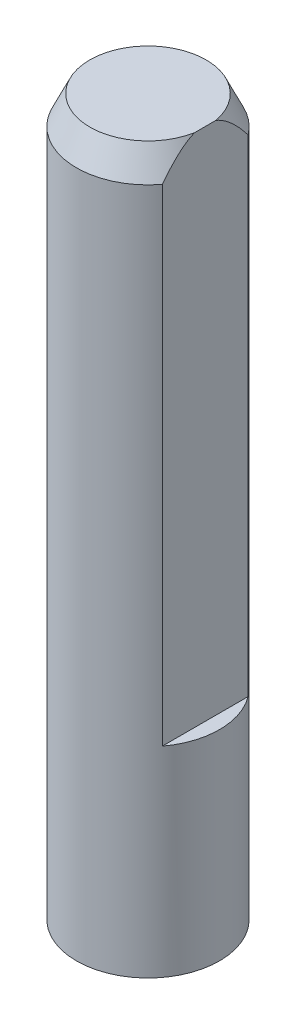
ISO-10303-21;
HEADER;
FILE_DESCRIPTION(('STEP AP214'),'2;1');
FILE_NAME('part.step','',(''),(''),'','','');
FILE_SCHEMA(('AUTOMOTIVE_DESIGN { 1 0 10303 214 1 1 1 1 }'));
ENDSEC;
DATA;
#1=APPLICATION_CONTEXT('core data for automotive mechanical design processes');
#2=APPLICATION_PROTOCOL_DEFINITION('international standard','automotive_design',2000,#1);
#3=PRODUCT_CONTEXT('',#1,'mechanical');
#4=PRODUCT('Part','Part','',(#3));
#5=PRODUCT_RELATED_PRODUCT_CATEGORY('part','',(#4));
#6=PRODUCT_DEFINITION_FORMATION('','',#4);
#7=PRODUCT_DEFINITION_CONTEXT('part definition',#1,'design');
#8=PRODUCT_DEFINITION('design','',#6,#7);
#9=PRODUCT_DEFINITION_SHAPE('','',#8);
#10=(LENGTH_UNIT() NAMED_UNIT(*) SI_UNIT(.MILLI.,.METRE.));
#11=(NAMED_UNIT(*) PLANE_ANGLE_UNIT() SI_UNIT($,.RADIAN.));
#12=(NAMED_UNIT(*) SI_UNIT($,.STERADIAN.) SOLID_ANGLE_UNIT());
#13=UNCERTAINTY_MEASURE_WITH_UNIT(LENGTH_MEASURE(1.E-05),#10,'distance_accuracy_value','');
#14=(GEOMETRIC_REPRESENTATION_CONTEXT(3) GLOBAL_UNCERTAINTY_ASSIGNED_CONTEXT((#13)) GLOBAL_UNIT_ASSIGNED_CONTEXT((#10,
#11,#12)) REPRESENTATION_CONTEXT('',''));
#15=CARTESIAN_POINT('',(0.,0.,0.));
#16=DIRECTION('',(0.,0.,1.));
#17=DIRECTION('',(1.,0.,0.));
#18=AXIS2_PLACEMENT_3D('',#15,#16,#17);
#19=CARTESIAN_POINT('',(0.,25.,0.));
#20=DIRECTION('',(0.,-1.,0.));
#21=DIRECTION('',(0.,0.,-1.));
#22=AXIS2_PLACEMENT_3D('',#19,#20,#21);
#23=CYLINDRICAL_SURFACE('',#22,2.5);
#24=DIRECTION('',(0.,-1.,0.));
#25=VECTOR('',#24,1.);
#26=CARTESIAN_POINT('',(2.,25.,1.5));
#27=LINE('',#26,#25);
#28=CARTESIAN_POINT('',(2.,7.,1.5));
#29=VERTEX_POINT('',#28);
#30=CARTESIAN_POINT('',(2.,24.,1.5));
#31=VERTEX_POINT('',#30);
#32=EDGE_CURVE('E75',#29,#31,#27,.F.);
#33=ORIENTED_EDGE('',*,*,#32,.T.);
#34=CARTESIAN_POINT('',(0.,24.,0.));
#35=DIRECTION('',(0.,1.,0.));
#36=DIRECTION('',(0.,0.,1.));
#37=AXIS2_PLACEMENT_3D('',#34,#35,#36);
#38=CIRCLE('',#37,2.5);
#39=CARTESIAN_POINT('',(2.,24.,-1.5));
#40=VERTEX_POINT('',#39);
#41=EDGE_CURVE('E11',#31,#40,#38,.F.);
#42=ORIENTED_EDGE('',*,*,#41,.T.);
#43=DIRECTION('',(0.,-1.,0.));
#44=VECTOR('',#43,1.);
#45=CARTESIAN_POINT('',(2.,25.,-1.5));
#46=LINE('',#45,#44);
#47=CARTESIAN_POINT('',(2.,7.,-1.5));
#48=VERTEX_POINT('',#47);
#49=EDGE_CURVE('E68',#40,#48,#46,.T.);
#50=ORIENTED_EDGE('',*,*,#49,.T.);
#51=CARTESIAN_POINT('',(0.,7.,0.));
#52=DIRECTION('',(0.,-1.,0.));
#53=DIRECTION('',(0.,0.,-1.));
#54=AXIS2_PLACEMENT_3D('',#51,#52,#53);
#55=CIRCLE('',#54,2.5);
#56=EDGE_CURVE('E71',#48,#29,#55,.T.);
#57=ORIENTED_EDGE('',*,*,#56,.T.);
#58=EDGE_LOOP('',(#33,#42,#50,#57));
#59=FACE_BOUND('',#58,.T.);
#60=CARTESIAN_POINT('',(0.,0.,0.));
#61=DIRECTION('',(0.,1.,0.));
#62=DIRECTION('',(0.,0.,1.));
#63=AXIS2_PLACEMENT_3D('',#60,#61,#62);
#64=CIRCLE('',#63,2.5);
#65=CARTESIAN_POINT('',(0.,0.,2.5));
#66=VERTEX_POINT('',#65);
#67=EDGE_CURVE('E74',#66,#66,#64,.T.);
#68=ORIENTED_EDGE('',*,*,#67,.T.);
#69=EDGE_LOOP('',(#68));
#70=FACE_BOUND('',#69,.T.);
#71=ADVANCED_FACE('F36',(#59,#70),#23,.T.);
#72=CARTESIAN_POINT('',(0.,25.,0.));
#73=DIRECTION('',(0.,1.,0.));
#74=DIRECTION('',(0.,0.,1.));
#75=AXIS2_PLACEMENT_3D('',#72,#73,#74);
#76=PLANE('',#75);
#77=DIRECTION('',(0.,0.,1.));
#78=VECTOR('',#77,1.);
#79=CARTESIAN_POINT('',(2.,25.,0.));
#80=LINE('',#79,#78);
#81=CARTESIAN_POINT('',(2.,25.,-0.368652331172611));
#82=VERTEX_POINT('',#81);
#83=CARTESIAN_POINT('',(2.,25.,0.36865233117261));
#84=VERTEX_POINT('',#83);
#85=EDGE_CURVE('E82',#82,#84,#80,.T.);
#86=ORIENTED_EDGE('',*,*,#85,.F.);
#87=CARTESIAN_POINT('',(0.,25.,0.));
#88=DIRECTION('',(0.,1.,0.));
#89=DIRECTION('',(0.,0.,1.));
#90=AXIS2_PLACEMENT_3D('',#87,#88,#89);
#91=CIRCLE('',#90,2.033692341845);
#92=EDGE_CURVE('E81',#82,#84,#91,.T.);
#93=ORIENTED_EDGE('',*,*,#92,.T.);
#94=EDGE_LOOP('',(#86,#93));
#95=FACE_BOUND('',#94,.T.);
#96=ADVANCED_FACE('F107',(#95),#76,.T.);
#97=CARTESIAN_POINT('',(0.,0.,0.));
#98=DIRECTION('',(0.,1.,0.));
#99=DIRECTION('',(0.,0.,1.));
#100=AXIS2_PLACEMENT_3D('',#97,#98,#99);
#101=PLANE('',#100);
#102=ORIENTED_EDGE('',*,*,#67,.F.);
#103=EDGE_LOOP('',(#102));
#104=FACE_BOUND('',#103,.T.);
#105=ADVANCED_FACE('F111',(#104),#101,.F.);
#106=CARTESIAN_POINT('',(0.,7.,0.));
#107=DIRECTION('',(0.,-1.,0.));
#108=DIRECTION('',(0.,0.,-1.));
#109=AXIS2_PLACEMENT_3D('',#106,#107,#108);
#110=PLANE('',#109);
#111=DIRECTION('',(0.,0.,1.));
#112=VECTOR('',#111,1.);
#113=CARTESIAN_POINT('',(2.,7.,-2.59898780556665));
#114=LINE('',#113,#112);
#115=EDGE_CURVE('E80',#48,#29,#114,.T.);
#116=ORIENTED_EDGE('',*,*,#115,.T.);
#117=ORIENTED_EDGE('',*,*,#56,.F.);
#118=EDGE_LOOP('',(#116,#117));
#119=FACE_BOUND('',#118,.T.);
#120=ADVANCED_FACE('F79',(#119),#110,.F.);
#121=CARTESIAN_POINT('',(2.,7.,-2.59898780556665));
#122=DIRECTION('',(-1.,0.,0.));
#123=DIRECTION('',(0.,0.,1.));
#124=AXIS2_PLACEMENT_3D('',#121,#122,#123);
#125=PLANE('',#124);
#126=ORIENTED_EDGE('',*,*,#85,.T.);
#127=CARTESIAN_POINT('',(2.,25.,0.36865233117261));
#128=CARTESIAN_POINT('',(2.,24.9773657798963,0.42670392910476));
#129=CARTESIAN_POINT('',(2.,24.9504626381934,0.482814543085763));
#130=CARTESIAN_POINT('',(2.,24.8902538012062,0.591124855930087));
#131=CARTESIAN_POINT('',(2.,24.8569844358804,0.643344515881336));
#132=CARTESIAN_POINT('',(2.,24.786404592297,0.743740787253262));
#133=CARTESIAN_POINT('',(2.,24.749160460305,0.791965423627912));
#134=CARTESIAN_POINT('',(2.,24.6713571421415,0.88576788745465));
#135=CARTESIAN_POINT('',(2.,24.6307928868007,0.931341478736168));
#136=CARTESIAN_POINT('',(2.,24.5443099672193,1.02331266368631));
#137=CARTESIAN_POINT('',(2.,24.4982153425337,1.06954324074633));
#138=CARTESIAN_POINT('',(2.,24.4039747671754,1.15980764517217));
#139=CARTESIAN_POINT('',(2.,24.3558296932559,1.20384239431132));
#140=CARTESIAN_POINT('',(2.,24.2571467445905,1.29082119520437));
#141=CARTESIAN_POINT('',(2.,24.2065824329501,1.33373506087849));
#142=CARTESIAN_POINT('',(2.,24.1041715210551,1.41797868682842));
#143=CARTESIAN_POINT('',(2.,24.0523252789949,1.45930888156157));
#144=CARTESIAN_POINT('',(2.,24.,1.5));
#145=B_SPLINE_CURVE_WITH_KNOTS('',3,(#127,#128,#129,#130,#131,#132,#133,#134,#135,#136,#137,
#138,#139,#140,#141,#142,#143,#144),.UNSPECIFIED.,.F.,.F.,(4,2,2,2,2,2,2,2,4),(0.,
0.18638024698093,0.371726998600596,0.55435828703451,0.737273813580688,0.933038967509208,
1.12872123835925,1.32764771590918,1.52651922431964),.UNSPECIFIED.);
#146=EDGE_CURVE('E46',#84,#31,#145,.T.);
#147=ORIENTED_EDGE('',*,*,#146,.T.);
#148=ORIENTED_EDGE('',*,*,#32,.F.);
#149=ORIENTED_EDGE('',*,*,#115,.F.);
#150=ORIENTED_EDGE('',*,*,#49,.F.);
#151=CARTESIAN_POINT('',(2.,24.,-1.5));
#152=CARTESIAN_POINT('',(2.,24.0638747366211,-1.45029792611991));
#153=CARTESIAN_POINT('',(2.,24.1270645061241,-1.39966276475568));
#154=CARTESIAN_POINT('',(2.,24.2515571312178,-1.29582048257785));
#155=CARTESIAN_POINT('',(2.,24.312854826939,-1.24260719823401));
#156=CARTESIAN_POINT('',(2.,24.4313150366005,-1.13442833916408));
#157=CARTESIAN_POINT('',(2.,24.4885407483534,-1.07953290122854));
#158=CARTESIAN_POINT('',(2.,24.5992519376495,-0.966154748771285));
#159=CARTESIAN_POINT('',(2.,24.6527400377277,-0.907674604697811));
#160=CARTESIAN_POINT('',(2.,24.7635661887545,-0.77516137191873));
#161=CARTESIAN_POINT('',(2.,24.8198669402364,-0.700222538667871));
#162=CARTESIAN_POINT('',(2.,24.8954536358406,-0.581387655238481));
#163=CARTESIAN_POINT('',(2.,24.9192965547492,-0.540418647621363));
#164=CARTESIAN_POINT('',(2.,24.9629524310468,-0.456225036774967));
#165=CARTESIAN_POINT('',(2.,24.9827513265278,-0.412993198333239));
#166=CARTESIAN_POINT('',(2.,25.,-0.368652331172624));
#167=B_SPLINE_CURVE_WITH_KNOTS('',3,(#151,#152,#153,#154,#155,#156,#157,#158,#159,#160,#161,
#162,#163,#164,#165,#166),.UNSPECIFIED.,.F.,.F.,(4,2,2,2,2,2,2,4),(0.,0.242840736329197,
0.486293823975883,0.724050354417472,0.961638349584109,1.24195015127265,1.38395496425036,
1.52644545276449),.UNSPECIFIED.);
#168=EDGE_CURVE('E93',#40,#82,#167,.T.);
#169=ORIENTED_EDGE('',*,*,#168,.T.);
#170=EDGE_LOOP('',(#126,#147,#148,#149,#150,#169));
#171=FACE_BOUND('',#170,.T.);
#172=ADVANCED_FACE('F84',(#171),#125,.F.);
#173=CARTESIAN_POINT('',(0.,25.,0.));
#174=DIRECTION('',(0.,-1.,0.));
#175=DIRECTION('',(0.,0.,-1.));
#176=AXIS2_PLACEMENT_3D('',#173,#174,#175);
#177=CONICAL_SURFACE('',#176,2.033692341845,0.436332312998579);
#178=ORIENTED_EDGE('',*,*,#168,.F.);
#179=ORIENTED_EDGE('',*,*,#41,.F.);
#180=ORIENTED_EDGE('',*,*,#146,.F.);
#181=ORIENTED_EDGE('',*,*,#92,.F.);
#182=EDGE_LOOP('',(#178,#179,#180,#181));
#183=FACE_BOUND('',#182,.T.);
#184=ADVANCED_FACE('F39',(#183),#177,.T.);
#185=CLOSED_SHELL('',(#71,#96,#105,#120,#172,#184));
#186=MANIFOLD_SOLID_BREP('B2',#185);
#187=ADVANCED_BREP_SHAPE_REPRESENTATION('',(#18,#186),#14);
#188=SHAPE_DEFINITION_REPRESENTATION(#9,#187);
ENDSEC;
END-ISO-10303-21;
